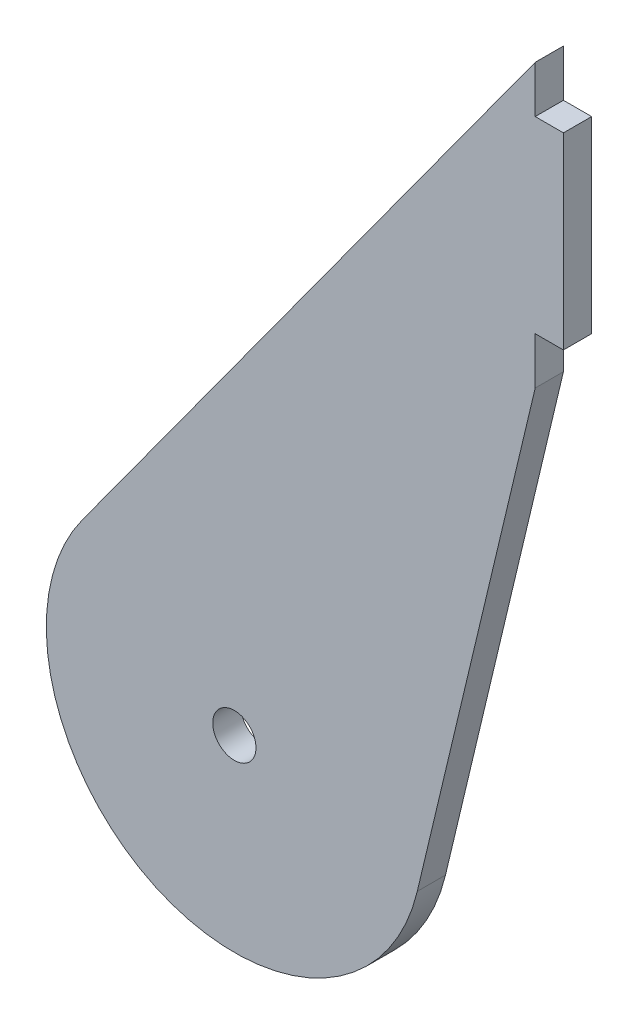
ISO-10303-21;
HEADER;
FILE_DESCRIPTION(('STEP AP214'),'2;1');
FILE_NAME('part.step','',(''),(''),'','','');
FILE_SCHEMA(('AUTOMOTIVE_DESIGN { 1 0 10303 214 1 1 1 1 }'));
ENDSEC;
DATA;
#1=APPLICATION_CONTEXT('core data for automotive mechanical design processes');
#2=APPLICATION_PROTOCOL_DEFINITION('international standard','automotive_design',2000,#1);
#3=PRODUCT_CONTEXT('',#1,'mechanical');
#4=PRODUCT('Part','Part','',(#3));
#5=PRODUCT_RELATED_PRODUCT_CATEGORY('part','',(#4));
#6=PRODUCT_DEFINITION_FORMATION('','',#4);
#7=PRODUCT_DEFINITION_CONTEXT('part definition',#1,'design');
#8=PRODUCT_DEFINITION('design','',#6,#7);
#9=PRODUCT_DEFINITION_SHAPE('','',#8);
#10=(LENGTH_UNIT() NAMED_UNIT(*) SI_UNIT(.MILLI.,.METRE.));
#11=(NAMED_UNIT(*) PLANE_ANGLE_UNIT() SI_UNIT($,.RADIAN.));
#12=(NAMED_UNIT(*) SI_UNIT($,.STERADIAN.) SOLID_ANGLE_UNIT());
#13=UNCERTAINTY_MEASURE_WITH_UNIT(LENGTH_MEASURE(1.E-05),#10,'distance_accuracy_value','');
#14=(GEOMETRIC_REPRESENTATION_CONTEXT(3) GLOBAL_UNCERTAINTY_ASSIGNED_CONTEXT((#13)) GLOBAL_UNIT_ASSIGNED_CONTEXT((#10,
#11,#12)) REPRESENTATION_CONTEXT('',''));
#15=CARTESIAN_POINT('',(0.,0.,0.));
#16=DIRECTION('',(0.,0.,1.));
#17=DIRECTION('',(1.,0.,0.));
#18=AXIS2_PLACEMENT_3D('',#15,#16,#17);
#19=CARTESIAN_POINT('',(32.,78.,-3.));
#20=DIRECTION('',(1.,0.,0.));
#21=DIRECTION('',(0.,0.,-1.));
#22=AXIS2_PLACEMENT_3D('',#19,#20,#21);
#23=PLANE('',#22);
#24=DIRECTION('',(0.,0.,1.));
#25=VECTOR('',#24,1.);
#26=CARTESIAN_POINT('',(32.,73.,0.));
#27=LINE('',#26,#25);
#28=CARTESIAN_POINT('',(32.,73.,-3.));
#29=VERTEX_POINT('',#28);
#30=CARTESIAN_POINT('',(32.,73.,0.));
#31=VERTEX_POINT('',#30);
#32=EDGE_CURVE('E50',#29,#31,#27,.T.);
#33=ORIENTED_EDGE('',*,*,#32,.F.);
#34=DIRECTION('',(0.,1.,0.));
#35=VECTOR('',#34,1.);
#36=CARTESIAN_POINT('',(32.,78.,-3.));
#37=LINE('',#36,#35);
#38=CARTESIAN_POINT('',(32.,78.,-3.));
#39=VERTEX_POINT('',#38);
#40=EDGE_CURVE('E156',#29,#39,#37,.T.);
#41=ORIENTED_EDGE('',*,*,#40,.T.);
#42=DIRECTION('',(0.,0.,1.));
#43=VECTOR('',#42,1.);
#44=CARTESIAN_POINT('',(32.,78.,-3.));
#45=LINE('',#44,#43);
#46=CARTESIAN_POINT('',(32.,78.,0.));
#47=VERTEX_POINT('',#46);
#48=EDGE_CURVE('E42',#39,#47,#45,.T.);
#49=ORIENTED_EDGE('',*,*,#48,.T.);
#50=DIRECTION('',(0.,1.,0.));
#51=VECTOR('',#50,1.);
#52=CARTESIAN_POINT('',(32.,78.,0.));
#53=LINE('',#52,#51);
#54=EDGE_CURVE('E55',#31,#47,#53,.T.);
#55=ORIENTED_EDGE('',*,*,#54,.F.);
#56=EDGE_LOOP('',(#33,#41,#49,#55));
#57=FACE_BOUND('',#56,.T.);
#58=ADVANCED_FACE('F33',(#57),#23,.T.);
#59=CARTESIAN_POINT('',(0.,0.,-3.));
#60=DIRECTION('',(0.,0.,1.));
#61=DIRECTION('',(1.,0.,0.));
#62=AXIS2_PLACEMENT_3D('',#59,#60,#61);
#63=CYLINDRICAL_SURFACE('',#62,20.);
#64=CARTESIAN_POINT('',(0.,0.,0.));
#65=DIRECTION('',(0.,0.,1.));
#66=DIRECTION('',(1.,0.,0.));
#67=AXIS2_PLACEMENT_3D('',#64,#65,#66);
#68=CIRCLE('',#67,20.);
#69=CARTESIAN_POINT('',(-16.1744111187009,11.7638609717747,0.));
#70=VERTEX_POINT('',#69);
#71=CARTESIAN_POINT('',(19.4550952982331,-4.63673019882206,0.));
#72=VERTEX_POINT('',#71);
#73=EDGE_CURVE('E148',#70,#72,#68,.T.);
#74=ORIENTED_EDGE('',*,*,#73,.F.);
#75=DIRECTION('',(0.,0.,1.));
#76=VECTOR('',#75,1.);
#77=CARTESIAN_POINT('',(-16.1744111187009,11.7638609717747,-3.));
#78=LINE('',#77,#76);
#79=CARTESIAN_POINT('',(-16.1744111187009,11.7638609717747,-3.));
#80=VERTEX_POINT('',#79);
#81=EDGE_CURVE('E11',#80,#70,#78,.T.);
#82=ORIENTED_EDGE('',*,*,#81,.F.);
#83=CARTESIAN_POINT('',(0.,0.,-3.));
#84=DIRECTION('',(0.,0.,1.));
#85=DIRECTION('',(1.,0.,0.));
#86=AXIS2_PLACEMENT_3D('',#83,#84,#85);
#87=CIRCLE('',#86,20.);
#88=CARTESIAN_POINT('',(19.4550952982331,-4.63673019882206,-3.));
#89=VERTEX_POINT('',#88);
#90=EDGE_CURVE('E149',#80,#89,#87,.T.);
#91=ORIENTED_EDGE('',*,*,#90,.T.);
#92=DIRECTION('',(0.,0.,1.));
#93=VECTOR('',#92,1.);
#94=CARTESIAN_POINT('',(19.4550952982331,-4.63673019882206,-3.));
#95=LINE('',#94,#93);
#96=EDGE_CURVE('E179',#89,#72,#95,.T.);
#97=ORIENTED_EDGE('',*,*,#96,.T.);
#98=EDGE_LOOP('',(#74,#82,#91,#97));
#99=FACE_BOUND('',#98,.T.);
#100=ADVANCED_FACE('F35',(#99),#63,.T.);
#101=CARTESIAN_POINT('',(-16.1744111187009,11.7638609717747,-3.));
#102=DIRECTION('',(-0.808720555935045,0.588193048588736,0.));
#103=DIRECTION('',(-0.588193048588736,-0.808720555935045,0.));
#104=AXIS2_PLACEMENT_3D('',#101,#102,#103);
#105=PLANE('',#104);
#106=DIRECTION('',(-0.588193048588736,-0.808720555935045,0.));
#107=VECTOR('',#106,1.);
#108=CARTESIAN_POINT('',(-16.1744111187009,11.7638609717747,0.));
#109=LINE('',#108,#107);
#110=EDGE_CURVE('E153',#47,#70,#109,.T.);
#111=ORIENTED_EDGE('',*,*,#110,.F.);
#112=ORIENTED_EDGE('',*,*,#48,.F.);
#113=DIRECTION('',(-0.588193048588736,-0.808720555935045,0.));
#114=VECTOR('',#113,1.);
#115=CARTESIAN_POINT('',(-16.1744111187009,11.7638609717747,-3.));
#116=LINE('',#115,#114);
#117=EDGE_CURVE('E159',#39,#80,#116,.T.);
#118=ORIENTED_EDGE('',*,*,#117,.T.);
#119=ORIENTED_EDGE('',*,*,#81,.T.);
#120=EDGE_LOOP('',(#111,#112,#118,#119));
#121=FACE_BOUND('',#120,.T.);
#122=ADVANCED_FACE('F188',(#121),#105,.T.);
#123=DIRECTION('',(0.,0.,-1.));
#124=VECTOR('',#123,1.);
#125=CARTESIAN_POINT('',(32.,53.,0.));
#126=LINE('',#125,#124);
#127=CARTESIAN_POINT('',(32.,53.,0.));
#128=VERTEX_POINT('',#127);
#129=CARTESIAN_POINT('',(32.,53.,-3.));
#130=VERTEX_POINT('',#129);
#131=EDGE_CURVE('E138',#128,#130,#126,.T.);
#132=ORIENTED_EDGE('',*,*,#131,.F.);
#133=CARTESIAN_POINT('',(32.,48.,0.));
#134=VERTEX_POINT('',#133);
#135=EDGE_CURVE('E123',#134,#128,#53,.T.);
#136=ORIENTED_EDGE('',*,*,#135,.F.);
#137=DIRECTION('',(0.,0.,1.));
#138=VECTOR('',#137,1.);
#139=CARTESIAN_POINT('',(32.,48.,-3.));
#140=LINE('',#139,#138);
#141=CARTESIAN_POINT('',(32.,48.,-3.));
#142=VERTEX_POINT('',#141);
#143=EDGE_CURVE('E178',#142,#134,#140,.T.);
#144=ORIENTED_EDGE('',*,*,#143,.F.);
#145=EDGE_CURVE('E165',#142,#130,#37,.T.);
#146=ORIENTED_EDGE('',*,*,#145,.T.);
#147=EDGE_LOOP('',(#132,#136,#144,#146));
#148=FACE_BOUND('',#147,.T.);
#149=ADVANCED_FACE('F198',(#148),#23,.T.);
#150=CARTESIAN_POINT('',(32.,48.,-3.));
#151=DIRECTION('',(0.972754764911655,-0.231836509941103,0.));
#152=DIRECTION('',(0.231836509941103,0.972754764911655,0.));
#153=AXIS2_PLACEMENT_3D('',#150,#151,#152);
#154=PLANE('',#153);
#155=DIRECTION('',(0.231836509941103,0.972754764911655,0.));
#156=VECTOR('',#155,1.);
#157=CARTESIAN_POINT('',(32.,48.,0.));
#158=LINE('',#157,#156);
#159=EDGE_CURVE('E169',#72,#134,#158,.T.);
#160=ORIENTED_EDGE('',*,*,#159,.F.);
#161=ORIENTED_EDGE('',*,*,#96,.F.);
#162=DIRECTION('',(0.231836509941103,0.972754764911655,0.));
#163=VECTOR('',#162,1.);
#164=CARTESIAN_POINT('',(32.,48.,-3.));
#165=LINE('',#164,#163);
#166=EDGE_CURVE('E152',#89,#142,#165,.T.);
#167=ORIENTED_EDGE('',*,*,#166,.T.);
#168=ORIENTED_EDGE('',*,*,#143,.T.);
#169=EDGE_LOOP('',(#160,#161,#167,#168));
#170=FACE_BOUND('',#169,.T.);
#171=ADVANCED_FACE('F204',(#170),#154,.T.);
#172=CARTESIAN_POINT('',(0.,0.,-3.));
#173=DIRECTION('',(0.,0.,1.));
#174=DIRECTION('',(1.,0.,0.));
#175=AXIS2_PLACEMENT_3D('',#172,#173,#174);
#176=PLANE('',#175);
#177=CARTESIAN_POINT('',(0.,0.,-3.));
#178=DIRECTION('',(0.,0.,1.));
#179=DIRECTION('',(1.,0.,0.));
#180=AXIS2_PLACEMENT_3D('',#177,#178,#179);
#181=CIRCLE('',#180,2.3);
#182=CARTESIAN_POINT('',(2.3,0.,-3.));
#183=VERTEX_POINT('',#182);
#184=EDGE_CURVE('E127',#183,#183,#181,.T.);
#185=ORIENTED_EDGE('',*,*,#184,.T.);
#186=EDGE_LOOP('',(#185));
#187=FACE_BOUND('',#186,.T.);
#188=ORIENTED_EDGE('',*,*,#90,.F.);
#189=ORIENTED_EDGE('',*,*,#117,.F.);
#190=ORIENTED_EDGE('',*,*,#40,.F.);
#191=DIRECTION('',(-1.,0.,0.));
#192=VECTOR('',#191,1.);
#193=CARTESIAN_POINT('',(35.,73.,-3.));
#194=LINE('',#193,#192);
#195=CARTESIAN_POINT('',(35.,73.,-3.));
#196=VERTEX_POINT('',#195);
#197=EDGE_CURVE('E129',#196,#29,#194,.T.);
#198=ORIENTED_EDGE('',*,*,#197,.F.);
#199=DIRECTION('',(0.,1.,0.));
#200=VECTOR('',#199,1.);
#201=CARTESIAN_POINT('',(35.,73.,-3.));
#202=LINE('',#201,#200);
#203=CARTESIAN_POINT('',(35.,53.,-3.));
#204=VERTEX_POINT('',#203);
#205=EDGE_CURVE('E107',#204,#196,#202,.T.);
#206=ORIENTED_EDGE('',*,*,#205,.F.);
#207=DIRECTION('',(-1.,0.,0.));
#208=VECTOR('',#207,1.);
#209=CARTESIAN_POINT('',(35.,53.,-3.));
#210=LINE('',#209,#208);
#211=EDGE_CURVE('E104',#204,#130,#210,.T.);
#212=ORIENTED_EDGE('',*,*,#211,.T.);
#213=ORIENTED_EDGE('',*,*,#145,.F.);
#214=ORIENTED_EDGE('',*,*,#166,.F.);
#215=EDGE_LOOP('',(#188,#189,#190,#198,#206,#212,#213,#214));
#216=FACE_BOUND('',#215,.T.);
#217=ADVANCED_FACE('F191',(#187,#216),#176,.F.);
#218=CARTESIAN_POINT('',(0.,0.,0.));
#219=DIRECTION('',(0.,0.,1.));
#220=DIRECTION('',(1.,0.,0.));
#221=AXIS2_PLACEMENT_3D('',#218,#219,#220);
#222=PLANE('',#221);
#223=CARTESIAN_POINT('',(0.,0.,0.));
#224=DIRECTION('',(0.,0.,1.));
#225=DIRECTION('',(1.,0.,0.));
#226=AXIS2_PLACEMENT_3D('',#223,#224,#225);
#227=CIRCLE('',#226,2.3);
#228=CARTESIAN_POINT('',(2.3,0.,0.));
#229=VERTEX_POINT('',#228);
#230=EDGE_CURVE('E124',#229,#229,#227,.T.);
#231=ORIENTED_EDGE('',*,*,#230,.F.);
#232=EDGE_LOOP('',(#231));
#233=FACE_BOUND('',#232,.T.);
#234=ORIENTED_EDGE('',*,*,#73,.T.);
#235=ORIENTED_EDGE('',*,*,#159,.T.);
#236=ORIENTED_EDGE('',*,*,#135,.T.);
#237=DIRECTION('',(-1.,0.,0.));
#238=VECTOR('',#237,1.);
#239=CARTESIAN_POINT('',(35.,53.,0.));
#240=LINE('',#239,#238);
#241=CARTESIAN_POINT('',(35.,53.,0.));
#242=VERTEX_POINT('',#241);
#243=EDGE_CURVE('E102',#242,#128,#240,.T.);
#244=ORIENTED_EDGE('',*,*,#243,.F.);
#245=DIRECTION('',(0.,-1.,0.));
#246=VECTOR('',#245,1.);
#247=CARTESIAN_POINT('',(35.,73.,0.));
#248=LINE('',#247,#246);
#249=CARTESIAN_POINT('',(35.,73.,0.));
#250=VERTEX_POINT('',#249);
#251=EDGE_CURVE('E108',#250,#242,#248,.T.);
#252=ORIENTED_EDGE('',*,*,#251,.F.);
#253=DIRECTION('',(-1.,0.,0.));
#254=VECTOR('',#253,1.);
#255=CARTESIAN_POINT('',(35.,73.,0.));
#256=LINE('',#255,#254);
#257=EDGE_CURVE('E139',#250,#31,#256,.T.);
#258=ORIENTED_EDGE('',*,*,#257,.T.);
#259=ORIENTED_EDGE('',*,*,#54,.T.);
#260=ORIENTED_EDGE('',*,*,#110,.T.);
#261=EDGE_LOOP('',(#234,#235,#236,#244,#252,#258,#259,#260));
#262=FACE_BOUND('',#261,.T.);
#263=ADVANCED_FACE('F120',(#233,#262),#222,.T.);
#264=CARTESIAN_POINT('',(0.,0.,-10.));
#265=DIRECTION('',(0.,0.,1.));
#266=DIRECTION('',(1.,0.,0.));
#267=AXIS2_PLACEMENT_3D('',#264,#265,#266);
#268=CYLINDRICAL_SURFACE('',#267,2.3);
#269=ORIENTED_EDGE('',*,*,#230,.T.);
#270=EDGE_LOOP('',(#269));
#271=FACE_BOUND('',#270,.T.);
#272=ORIENTED_EDGE('',*,*,#184,.F.);
#273=EDGE_LOOP('',(#272));
#274=FACE_BOUND('',#273,.T.);
#275=ADVANCED_FACE('F222',(#271,#274),#268,.F.);
#276=CARTESIAN_POINT('',(35.,53.,0.));
#277=DIRECTION('',(0.,1.,0.));
#278=DIRECTION('',(0.,0.,1.));
#279=AXIS2_PLACEMENT_3D('',#276,#277,#278);
#280=PLANE('',#279);
#281=ORIENTED_EDGE('',*,*,#131,.T.);
#282=ORIENTED_EDGE('',*,*,#211,.F.);
#283=DIRECTION('',(0.,0.,-1.));
#284=VECTOR('',#283,1.);
#285=CARTESIAN_POINT('',(35.,53.,0.));
#286=LINE('',#285,#284);
#287=EDGE_CURVE('E97',#242,#204,#286,.T.);
#288=ORIENTED_EDGE('',*,*,#287,.F.);
#289=ORIENTED_EDGE('',*,*,#243,.T.);
#290=EDGE_LOOP('',(#281,#282,#288,#289));
#291=FACE_BOUND('',#290,.T.);
#292=ADVANCED_FACE('F100',(#291),#280,.F.);
#293=CARTESIAN_POINT('',(35.,73.,0.));
#294=DIRECTION('',(0.,-1.,0.));
#295=DIRECTION('',(0.,0.,-1.));
#296=AXIS2_PLACEMENT_3D('',#293,#294,#295);
#297=PLANE('',#296);
#298=ORIENTED_EDGE('',*,*,#32,.T.);
#299=ORIENTED_EDGE('',*,*,#257,.F.);
#300=DIRECTION('',(0.,0.,1.));
#301=VECTOR('',#300,1.);
#302=CARTESIAN_POINT('',(35.,73.,0.));
#303=LINE('',#302,#301);
#304=EDGE_CURVE('E113',#196,#250,#303,.T.);
#305=ORIENTED_EDGE('',*,*,#304,.F.);
#306=ORIENTED_EDGE('',*,*,#197,.T.);
#307=EDGE_LOOP('',(#298,#299,#305,#306));
#308=FACE_BOUND('',#307,.T.);
#309=ADVANCED_FACE('F214',(#308),#297,.F.);
#310=CARTESIAN_POINT('',(35.,0.,0.));
#311=DIRECTION('',(1.,0.,0.));
#312=DIRECTION('',(0.,0.,-1.));
#313=AXIS2_PLACEMENT_3D('',#310,#311,#312);
#314=PLANE('',#313);
#315=ORIENTED_EDGE('',*,*,#251,.T.);
#316=ORIENTED_EDGE('',*,*,#287,.T.);
#317=ORIENTED_EDGE('',*,*,#205,.T.);
#318=ORIENTED_EDGE('',*,*,#304,.T.);
#319=EDGE_LOOP('',(#315,#316,#317,#318));
#320=FACE_BOUND('',#319,.T.);
#321=ADVANCED_FACE('F111',(#320),#314,.T.);
#322=CLOSED_SHELL('',(#58,#100,#122,#149,#171,#217,#263,#275,#292,#309,#321));
#323=MANIFOLD_SOLID_BREP('B2',#322);
#324=ADVANCED_BREP_SHAPE_REPRESENTATION('',(#18,#323),#14);
#325=SHAPE_DEFINITION_REPRESENTATION(#9,#324);
ENDSEC;
END-ISO-10303-21;
